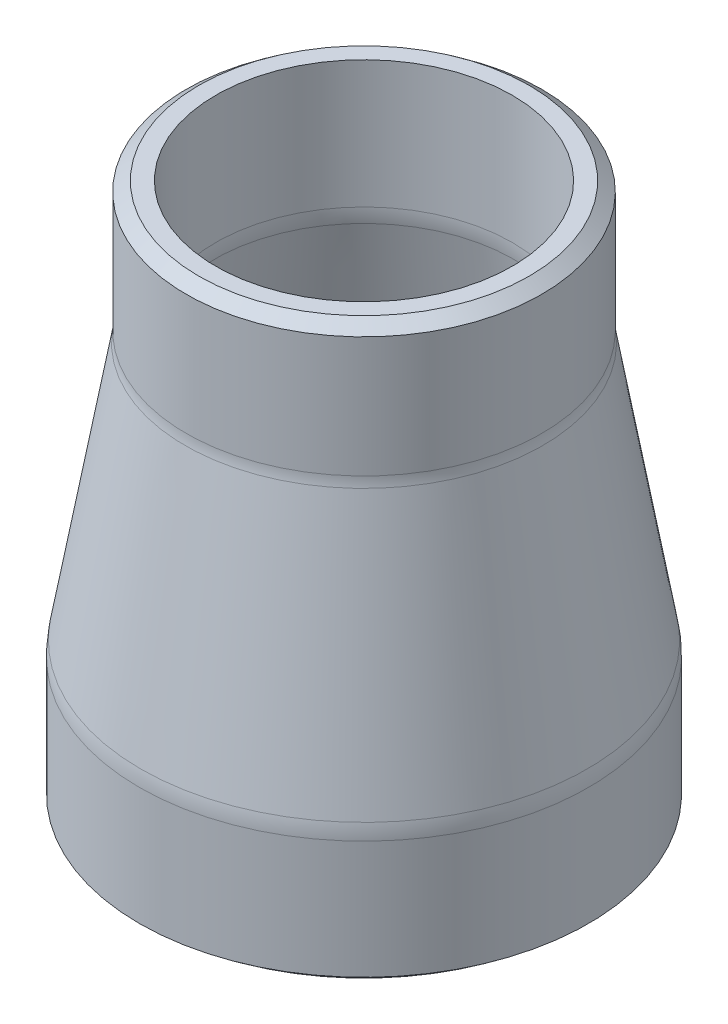
ISO-10303-21;
HEADER;
FILE_DESCRIPTION(('STEP AP214'),'2;1');
FILE_NAME('part.step','',(''),(''),'','','');
FILE_SCHEMA(('AUTOMOTIVE_DESIGN { 1 0 10303 214 1 1 1 1 }'));
ENDSEC;
DATA;
#1=APPLICATION_CONTEXT('core data for automotive mechanical design processes');
#2=APPLICATION_PROTOCOL_DEFINITION('international standard','automotive_design',2000,#1);
#3=PRODUCT_CONTEXT('',#1,'mechanical');
#4=PRODUCT('Part','Part','',(#3));
#5=PRODUCT_RELATED_PRODUCT_CATEGORY('part','',(#4));
#6=PRODUCT_DEFINITION_FORMATION('','',#4);
#7=PRODUCT_DEFINITION_CONTEXT('part definition',#1,'design');
#8=PRODUCT_DEFINITION('design','',#6,#7);
#9=PRODUCT_DEFINITION_SHAPE('','',#8);
#10=(LENGTH_UNIT() NAMED_UNIT(*) SI_UNIT(.MILLI.,.METRE.));
#11=(NAMED_UNIT(*) PLANE_ANGLE_UNIT() SI_UNIT($,.RADIAN.));
#12=(NAMED_UNIT(*) SI_UNIT($,.STERADIAN.) SOLID_ANGLE_UNIT());
#13=UNCERTAINTY_MEASURE_WITH_UNIT(LENGTH_MEASURE(1.E-05),#10,'distance_accuracy_value','');
#14=(GEOMETRIC_REPRESENTATION_CONTEXT(3) GLOBAL_UNCERTAINTY_ASSIGNED_CONTEXT((#13)) GLOBAL_UNIT_ASSIGNED_CONTEXT((#10,
#11,#12)) REPRESENTATION_CONTEXT('',''));
#15=CARTESIAN_POINT('',(0.,0.,0.));
#16=DIRECTION('',(0.,0.,1.));
#17=DIRECTION('',(1.,0.,0.));
#18=AXIS2_PLACEMENT_3D('',#15,#16,#17);
#19=CARTESIAN_POINT('',(0.,37.249759855706,0.));
#20=DIRECTION('',(0.,-1.,0.));
#21=DIRECTION('',(0.,0.,-1.));
#22=AXIS2_PLACEMENT_3D('',#19,#20,#21);
#23=TOROIDAL_SURFACE('',#22,20.2545251999995,5.07272219999945);
#24=CARTESIAN_POINT('',(0.,37.249759855706,0.));
#25=DIRECTION('',(0.,-1.,0.));
#26=DIRECTION('',(0.,0.,-1.));
#27=AXIS2_PLACEMENT_3D('',#24,#25,#26);
#28=CIRCLE('',#27,15.181803);
#29=CARTESIAN_POINT('',(0.,37.249759855706,-15.181803));
#30=VERTEX_POINT('',#29);
#31=EDGE_CURVE('E81',#30,#30,#28,.T.);
#32=ORIENTED_EDGE('',*,*,#31,.T.);
#33=EDGE_LOOP('',(#32));
#34=FACE_BOUND('',#33,.T.);
#35=CARTESIAN_POINT('',(0.,36.3839157042108,0.));
#36=DIRECTION('',(0.,-1.,0.));
#37=DIRECTION('',(0.,0.,-1.));
#38=AXIS2_PLACEMENT_3D('',#35,#36,#37);
#39=CIRCLE('',#38,15.2562430527324);
#40=CARTESIAN_POINT('',(0.,36.3839157042108,-15.2562430527324));
#41=VERTEX_POINT('',#40);
#42=EDGE_CURVE('E11',#41,#41,#39,.T.);
#43=ORIENTED_EDGE('',*,*,#42,.F.);
#44=EDGE_LOOP('',(#43));
#45=FACE_BOUND('',#44,.T.);
#46=ADVANCED_FACE('F34',(#34,#45),#23,.F.);
#47=CARTESIAN_POINT('',(0.,14.3727257900048,0.));
#48=DIRECTION('',(0.,-1.,0.));
#49=DIRECTION('',(0.,0.,-1.));
#50=AXIS2_PLACEMENT_3D('',#47,#48,#49);
#51=CONICAL_SURFACE('',#50,19.0692050851145,0.1715261419721);
#52=CARTESIAN_POINT('',(0.,14.3727257900048,0.));
#53=DIRECTION('',(0.,-1.,0.));
#54=DIRECTION('',(0.,0.,-1.));
#55=AXIS2_PLACEMENT_3D('',#52,#53,#54);
#56=CIRCLE('',#55,19.0692050851145);
#57=CARTESIAN_POINT('',(0.,14.3727257900048,-19.0692050851145));
#58=VERTEX_POINT('',#57);
#59=EDGE_CURVE('E44',#58,#58,#56,.T.);
#60=ORIENTED_EDGE('',*,*,#59,.F.);
#61=EDGE_LOOP('',(#60));
#62=FACE_BOUND('',#61,.T.);
#63=ORIENTED_EDGE('',*,*,#42,.T.);
#64=EDGE_LOOP('',(#63));
#65=FACE_BOUND('',#64,.T.);
#66=ADVANCED_FACE('F137',(#62,#65),#51,.T.);
#67=CARTESIAN_POINT('',(0.,13.0630977185676,0.));
#68=DIRECTION('',(0.,-1.,0.));
#69=DIRECTION('',(0.,0.,-1.));
#70=AXIS2_PLACEMENT_3D('',#67,#68,#69);
#71=TOROIDAL_SURFACE('',#70,11.5090793999995,7.67271960000052);
#72=CARTESIAN_POINT('',(0.,13.0630977185677,0.));
#73=DIRECTION('',(0.,-1.,0.));
#74=DIRECTION('',(0.,0.,-1.));
#75=AXIS2_PLACEMENT_3D('',#72,#73,#74);
#76=CIRCLE('',#75,19.181799);
#77=CARTESIAN_POINT('',(0.,13.0630977185677,-19.181799));
#78=VERTEX_POINT('',#77);
#79=EDGE_CURVE('E71',#78,#78,#76,.T.);
#80=ORIENTED_EDGE('',*,*,#79,.F.);
#81=EDGE_LOOP('',(#80));
#82=FACE_BOUND('',#81,.T.);
#83=ORIENTED_EDGE('',*,*,#59,.T.);
#84=EDGE_LOOP('',(#83));
#85=FACE_BOUND('',#84,.T.);
#86=ADVANCED_FACE('F143',(#82,#85),#71,.T.);
#87=CARTESIAN_POINT('',(0.,-88.7316911731979,0.));
#88=DIRECTION('',(0.,-1.,0.));
#89=DIRECTION('',(0.,0.,-1.));
#90=AXIS2_PLACEMENT_3D('',#87,#88,#89);
#91=CYLINDRICAL_SURFACE('',#90,19.181799);
#92=CARTESIAN_POINT('',(0.,2.99346489785924,0.));
#93=DIRECTION('',(0.,-1.,0.));
#94=DIRECTION('',(0.,0.,-1.));
#95=AXIS2_PLACEMENT_3D('',#92,#93,#94);
#96=CIRCLE('',#95,19.181799);
#97=CARTESIAN_POINT('',(0.,2.99346489785924,-19.181799));
#98=VERTEX_POINT('',#97);
#99=EDGE_CURVE('E82',#98,#98,#96,.T.);
#100=ORIENTED_EDGE('',*,*,#99,.F.);
#101=EDGE_LOOP('',(#100));
#102=FACE_BOUND('',#101,.T.);
#103=ORIENTED_EDGE('',*,*,#79,.T.);
#104=EDGE_LOOP('',(#103));
#105=FACE_BOUND('',#104,.T.);
#106=ADVANCED_FACE('F72',(#102,#105),#91,.T.);
#107=CARTESIAN_POINT('',(0.,37.466257708764,0.));
#108=DIRECTION('',(0.,-1.,0.));
#109=DIRECTION('',(0.,0.,-1.));
#110=AXIS2_PLACEMENT_3D('',#107,#108,#109);
#111=TOROIDAL_SURFACE('',#110,20.2545252,7.59090149999986);
#112=CARTESIAN_POINT('',(0.,37.466257708764,0.));
#113=DIRECTION('',(0.,-1.,0.));
#114=DIRECTION('',(0.,0.,-1.));
#115=AXIS2_PLACEMENT_3D('',#112,#113,#114);
#116=CIRCLE('',#115,12.6636237);
#117=CARTESIAN_POINT('',(0.,37.466257708764,-12.6636237));
#118=VERTEX_POINT('',#117);
#119=EDGE_CURVE('E93',#118,#118,#116,.T.);
#120=ORIENTED_EDGE('',*,*,#119,.F.);
#121=EDGE_LOOP('',(#120));
#122=FACE_BOUND('',#121,.T.);
#123=CARTESIAN_POINT('',(0.,36.1705948655767,0.));
#124=DIRECTION('',(0.,-1.,0.));
#125=DIRECTION('',(0.,0.,-1.));
#126=AXIS2_PLACEMENT_3D('',#123,#124,#125);
#127=CIRCLE('',#126,12.7750169688737);
#128=CARTESIAN_POINT('',(0.,36.1705948655767,-12.7750169688737));
#129=VERTEX_POINT('',#128);
#130=EDGE_CURVE('E74',#129,#129,#127,.T.);
#131=ORIENTED_EDGE('',*,*,#130,.T.);
#132=EDGE_LOOP('',(#131));
#133=FACE_BOUND('',#132,.T.);
#134=ADVANCED_FACE('F116',(#122,#133),#111,.T.);
#135=CARTESIAN_POINT('',(0.,36.1705948655767,0.));
#136=DIRECTION('',(0.,-1.,0.));
#137=DIRECTION('',(0.,0.,-1.));
#138=AXIS2_PLACEMENT_3D('',#135,#136,#137);
#139=CONICAL_SURFACE('',#138,12.7750169688737,0.1715261419721);
#140=ORIENTED_EDGE('',*,*,#130,.F.);
#141=EDGE_LOOP('',(#140));
#142=FACE_BOUND('',#141,.T.);
#143=CARTESIAN_POINT('',(0.,14.1594049513708,0.));
#144=DIRECTION('',(0.,-1.,0.));
#145=DIRECTION('',(0.,0.,-1.));
#146=AXIS2_PLACEMENT_3D('',#143,#144,#145);
#147=CIRCLE('',#146,16.5879790012558);
#148=CARTESIAN_POINT('',(0.,14.1594049513708,-16.5879790012558));
#149=VERTEX_POINT('',#148);
#150=EDGE_CURVE('E77',#149,#149,#147,.T.);
#151=ORIENTED_EDGE('',*,*,#150,.T.);
#152=EDGE_LOOP('',(#151));
#153=FACE_BOUND('',#152,.T.);
#154=ADVANCED_FACE('F119',(#142,#153),#139,.F.);
#155=CARTESIAN_POINT('',(0.,13.2795955716256,0.));
#156=DIRECTION('',(0.,-1.,0.));
#157=DIRECTION('',(0.,0.,-1.));
#158=AXIS2_PLACEMENT_3D('',#155,#156,#157);
#159=TOROIDAL_SURFACE('',#158,11.5090793999997,5.15454030000025);
#160=CARTESIAN_POINT('',(0.,13.2795955716256,0.));
#161=DIRECTION('',(0.,-1.,0.));
#162=DIRECTION('',(0.,0.,-1.));
#163=AXIS2_PLACEMENT_3D('',#160,#161,#162);
#164=CIRCLE('',#163,16.6636197);
#165=CARTESIAN_POINT('',(0.,13.2795955716256,-16.6636197));
#166=VERTEX_POINT('',#165);
#167=EDGE_CURVE('E89',#166,#166,#164,.T.);
#168=ORIENTED_EDGE('',*,*,#167,.T.);
#169=EDGE_LOOP('',(#168));
#170=FACE_BOUND('',#169,.T.);
#171=ORIENTED_EDGE('',*,*,#150,.F.);
#172=EDGE_LOOP('',(#171));
#173=FACE_BOUND('',#172,.T.);
#174=ADVANCED_FACE('F36',(#170,#173),#159,.F.);
#175=CARTESIAN_POINT('',(0.,-88.7316911731979,0.));
#176=DIRECTION('',(0.,-1.,0.));
#177=DIRECTION('',(0.,0.,-1.));
#178=AXIS2_PLACEMENT_3D('',#175,#176,#177);
#179=CYLINDRICAL_SURFACE('',#178,16.6636197);
#180=ORIENTED_EDGE('',*,*,#167,.F.);
#181=EDGE_LOOP('',(#180));
#182=FACE_BOUND('',#181,.T.);
#183=CARTESIAN_POINT('',(0.,2.17730882680214,0.));
#184=DIRECTION('',(0.,-1.,0.));
#185=DIRECTION('',(0.,0.,-1.));
#186=AXIS2_PLACEMENT_3D('',#183,#184,#185);
#187=CIRCLE('',#186,16.6636197);
#188=CARTESIAN_POINT('',(0.,2.17730882680214,-16.6636197));
#189=VERTEX_POINT('',#188);
#190=EDGE_CURVE('E90',#189,#189,#187,.T.);
#191=ORIENTED_EDGE('',*,*,#190,.T.);
#192=EDGE_LOOP('',(#191));
#193=FACE_BOUND('',#192,.T.);
#194=ADVANCED_FACE('F111',(#182,#193),#179,.F.);
#195=CARTESIAN_POINT('',(0.,-88.7316911731979,0.));
#196=DIRECTION('',(0.,-1.,0.));
#197=DIRECTION('',(0.,0.,-1.));
#198=AXIS2_PLACEMENT_3D('',#195,#196,#197);
#199=CYLINDRICAL_SURFACE('',#198,12.6636237);
#200=CARTESIAN_POINT('',(0.,48.3590808268021,0.));
#201=DIRECTION('',(0.,-1.,0.));
#202=DIRECTION('',(0.,0.,-1.));
#203=AXIS2_PLACEMENT_3D('',#200,#201,#202);
#204=CIRCLE('',#203,12.6636237);
#205=CARTESIAN_POINT('',(0.,48.3590808268021,-12.6636237));
#206=VERTEX_POINT('',#205);
#207=EDGE_CURVE('E86',#206,#206,#204,.T.);
#208=ORIENTED_EDGE('',*,*,#207,.F.);
#209=EDGE_LOOP('',(#208));
#210=FACE_BOUND('',#209,.T.);
#211=ORIENTED_EDGE('',*,*,#119,.T.);
#212=EDGE_LOOP('',(#211));
#213=FACE_BOUND('',#212,.T.);
#214=ADVANCED_FACE('F107',(#210,#213),#199,.F.);
#215=CARTESIAN_POINT('',(16.6636197,2.17730882680214,0.));
#216=DIRECTION('',(0.,-1.,0.));
#217=DIRECTION('',(0.,0.,-1.));
#218=AXIS2_PLACEMENT_3D('',#215,#216,#217);
#219=PLANE('',#218);
#220=ORIENTED_EDGE('',*,*,#190,.F.);
#221=EDGE_LOOP('',(#220));
#222=FACE_BOUND('',#221,.T.);
#223=CARTESIAN_POINT('',(0.,2.17730882680214,0.));
#224=DIRECTION('',(0.,-1.,0.));
#225=DIRECTION('',(0.,0.,-1.));
#226=AXIS2_PLACEMENT_3D('',#223,#224,#225);
#227=CIRCLE('',#226,18.1181637);
#228=CARTESIAN_POINT('',(0.,2.17730882680214,-18.1181637));
#229=VERTEX_POINT('',#228);
#230=EDGE_CURVE('E83',#229,#229,#227,.T.);
#231=ORIENTED_EDGE('',*,*,#230,.T.);
#232=EDGE_LOOP('',(#231));
#233=FACE_BOUND('',#232,.T.);
#234=ADVANCED_FACE('F110',(#222,#233),#219,.T.);
#235=CARTESIAN_POINT('',(0.,-88.7316911731979,0.));
#236=DIRECTION('',(0.,-1.,0.));
#237=DIRECTION('',(0.,0.,-1.));
#238=AXIS2_PLACEMENT_3D('',#235,#236,#237);
#239=CYLINDRICAL_SURFACE('',#238,15.181803);
#240=ORIENTED_EDGE('',*,*,#31,.F.);
#241=EDGE_LOOP('',(#240));
#242=FACE_BOUND('',#241,.T.);
#243=CARTESIAN_POINT('',(0.,47.542924755745,0.));
#244=DIRECTION('',(0.,-1.,0.));
#245=DIRECTION('',(0.,0.,-1.));
#246=AXIS2_PLACEMENT_3D('',#243,#244,#245);
#247=CIRCLE('',#246,15.181803);
#248=CARTESIAN_POINT('',(0.,47.542924755745,-15.181803));
#249=VERTEX_POINT('',#248);
#250=EDGE_CURVE('E38',#249,#249,#247,.T.);
#251=ORIENTED_EDGE('',*,*,#250,.T.);
#252=EDGE_LOOP('',(#251));
#253=FACE_BOUND('',#252,.T.);
#254=ADVANCED_FACE('F162',(#242,#253),#239,.T.);
#255=CARTESIAN_POINT('',(0.,2.99346489785924,0.));
#256=DIRECTION('',(0.,1.,0.));
#257=DIRECTION('',(0.,0.,1.));
#258=AXIS2_PLACEMENT_3D('',#255,#256,#257);
#259=CONICAL_SURFACE('',#258,19.181799,0.91629785729702);
#260=ORIENTED_EDGE('',*,*,#99,.T.);
#261=EDGE_LOOP('',(#260));
#262=FACE_BOUND('',#261,.T.);
#263=ORIENTED_EDGE('',*,*,#230,.F.);
#264=EDGE_LOOP('',(#263));
#265=FACE_BOUND('',#264,.T.);
#266=ADVANCED_FACE('F155',(#262,#265),#259,.T.);
#267=CARTESIAN_POINT('',(15.181803,48.3590808268021,0.));
#268=DIRECTION('',(0.,1.,0.));
#269=DIRECTION('',(0.,0.,1.));
#270=AXIS2_PLACEMENT_3D('',#267,#268,#269);
#271=PLANE('',#270);
#272=CARTESIAN_POINT('',(0.,48.3590808268021,0.));
#273=DIRECTION('',(0.,-1.,0.));
#274=DIRECTION('',(0.,0.,-1.));
#275=AXIS2_PLACEMENT_3D('',#272,#273,#274);
#276=CIRCLE('',#275,14.1181677);
#277=CARTESIAN_POINT('',(0.,48.3590808268021,-14.1181677));
#278=VERTEX_POINT('',#277);
#279=EDGE_CURVE('E96',#278,#278,#276,.T.);
#280=ORIENTED_EDGE('',*,*,#279,.F.);
#281=EDGE_LOOP('',(#280));
#282=FACE_BOUND('',#281,.T.);
#283=ORIENTED_EDGE('',*,*,#207,.T.);
#284=EDGE_LOOP('',(#283));
#285=FACE_BOUND('',#284,.T.);
#286=ADVANCED_FACE('F103',(#282,#285),#271,.T.);
#287=CARTESIAN_POINT('',(0.,48.3590808268021,0.));
#288=DIRECTION('',(0.,-1.,0.));
#289=DIRECTION('',(0.,0.,-1.));
#290=AXIS2_PLACEMENT_3D('',#287,#288,#289);
#291=CONICAL_SURFACE('',#290,14.1181677,0.916297857296978);
#292=ORIENTED_EDGE('',*,*,#279,.T.);
#293=EDGE_LOOP('',(#292));
#294=FACE_BOUND('',#293,.T.);
#295=ORIENTED_EDGE('',*,*,#250,.F.);
#296=EDGE_LOOP('',(#295));
#297=FACE_BOUND('',#296,.T.);
#298=ADVANCED_FACE('F149',(#294,#297),#291,.T.);
#299=CLOSED_SHELL('',(#46,#66,#86,#106,#134,#154,#174,#194,#214,#234,#254,#266,#286,#298));
#300=MANIFOLD_SOLID_BREP('B2',#299);
#301=ADVANCED_BREP_SHAPE_REPRESENTATION('',(#18,#300),#14);
#302=SHAPE_DEFINITION_REPRESENTATION(#9,#301);
ENDSEC;
END-ISO-10303-21;
